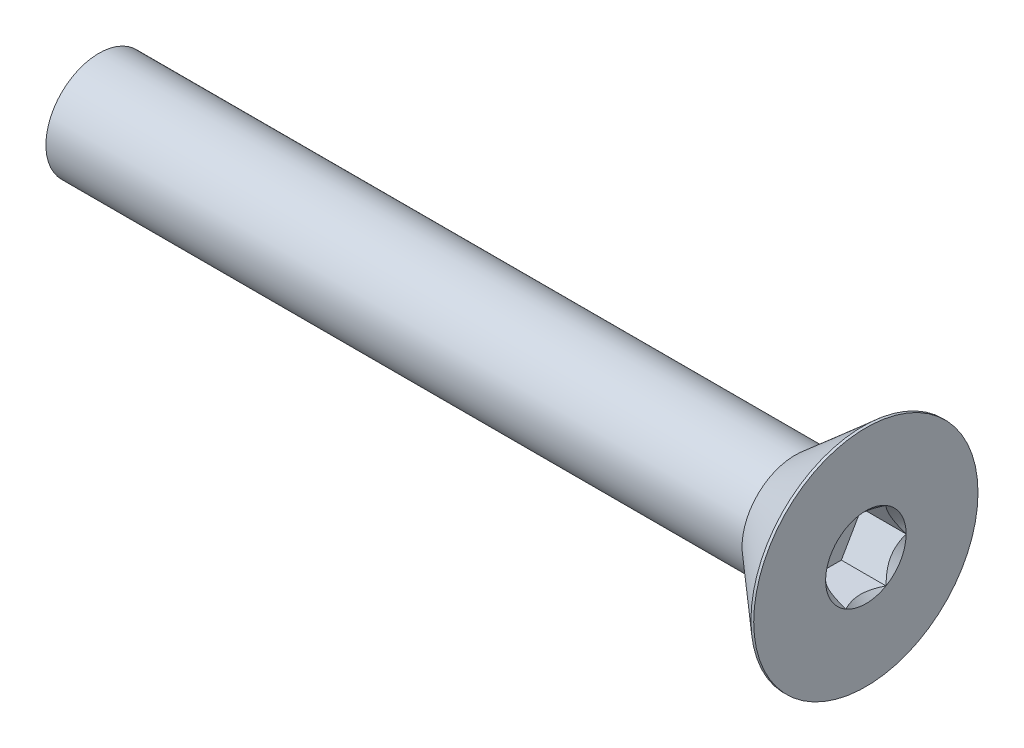
ISO-10303-21;
HEADER;
FILE_DESCRIPTION(('STEP AP214'),'2;1');
FILE_NAME('part.step','',(''),(''),'','','');
FILE_SCHEMA(('AUTOMOTIVE_DESIGN { 1 0 10303 214 1 1 1 1 }'));
ENDSEC;
DATA;
#1=APPLICATION_CONTEXT('core data for automotive mechanical design processes');
#2=APPLICATION_PROTOCOL_DEFINITION('international standard','automotive_design',2000,#1);
#3=PRODUCT_CONTEXT('',#1,'mechanical');
#4=PRODUCT('Part','Part','',(#3));
#5=PRODUCT_RELATED_PRODUCT_CATEGORY('part','',(#4));
#6=PRODUCT_DEFINITION_FORMATION('','',#4);
#7=PRODUCT_DEFINITION_CONTEXT('part definition',#1,'design');
#8=PRODUCT_DEFINITION('design','',#6,#7);
#9=PRODUCT_DEFINITION_SHAPE('','',#8);
#10=(LENGTH_UNIT() NAMED_UNIT(*) SI_UNIT(.MILLI.,.METRE.));
#11=(NAMED_UNIT(*) PLANE_ANGLE_UNIT() SI_UNIT($,.RADIAN.));
#12=(NAMED_UNIT(*) SI_UNIT($,.STERADIAN.) SOLID_ANGLE_UNIT());
#13=UNCERTAINTY_MEASURE_WITH_UNIT(LENGTH_MEASURE(1.E-05),#10,'distance_accuracy_value','');
#14=(GEOMETRIC_REPRESENTATION_CONTEXT(3) GLOBAL_UNCERTAINTY_ASSIGNED_CONTEXT((#13)) GLOBAL_UNIT_ASSIGNED_CONTEXT((#10,
#11,#12)) REPRESENTATION_CONTEXT('',''));
#15=CARTESIAN_POINT('',(0.,0.,0.));
#16=DIRECTION('',(0.,0.,1.));
#17=DIRECTION('',(1.,0.,0.));
#18=AXIS2_PLACEMENT_3D('',#15,#16,#17);
#19=CARTESIAN_POINT('',(1.193712867479,0.,0.));
#20=DIRECTION('',(1.,0.,0.));
#21=DIRECTION('',(0.,0.,-1.));
#22=AXIS2_PLACEMENT_3D('',#19,#20,#21);
#23=PLANE('',#22);
#24=DIRECTION('',(0.,-0.866025403784439,-0.5));
#25=VECTOR('',#24,1.);
#26=CARTESIAN_POINT('',(1.193712867479,-0.79375,1.3748153285078));
#27=LINE('',#26,#25);
#28=CARTESIAN_POINT('',(1.193712867479,0.,1.83308710467706));
#29=VERTEX_POINT('',#28);
#30=CARTESIAN_POINT('',(1.193712867479,-1.5875,0.916543552338532));
#31=VERTEX_POINT('',#30);
#32=EDGE_CURVE('E114',#29,#31,#27,.T.);
#33=ORIENTED_EDGE('',*,*,#32,.T.);
#34=DIRECTION('',(0.,0.,-1.));
#35=VECTOR('',#34,1.);
#36=CARTESIAN_POINT('',(1.193712867479,-1.5875,0.));
#37=LINE('',#36,#35);
#38=CARTESIAN_POINT('',(1.193712867479,-1.5875,-0.91654355233853));
#39=VERTEX_POINT('',#38);
#40=EDGE_CURVE('E81',#31,#39,#37,.T.);
#41=ORIENTED_EDGE('',*,*,#40,.T.);
#42=DIRECTION('',(0.,0.866025403784439,-0.5));
#43=VECTOR('',#42,1.);
#44=CARTESIAN_POINT('',(1.193712867479,-0.79375,-1.3748153285078));
#45=LINE('',#44,#43);
#46=CARTESIAN_POINT('',(1.193712867479,0.,-1.83308710467706));
#47=VERTEX_POINT('',#46);
#48=EDGE_CURVE('E83',#39,#47,#45,.T.);
#49=ORIENTED_EDGE('',*,*,#48,.T.);
#50=DIRECTION('',(0.,0.866025403784438,0.5));
#51=VECTOR('',#50,1.);
#52=CARTESIAN_POINT('',(1.193712867479,0.79375,-1.3748153285078));
#53=LINE('',#52,#51);
#54=CARTESIAN_POINT('',(1.193712867479,1.5875,-0.916543552338529));
#55=VERTEX_POINT('',#54);
#56=EDGE_CURVE('E84',#47,#55,#53,.T.);
#57=ORIENTED_EDGE('',*,*,#56,.T.);
#58=DIRECTION('',(0.,0.,1.));
#59=VECTOR('',#58,1.);
#60=CARTESIAN_POINT('',(1.193712867479,1.5875,0.));
#61=LINE('',#60,#59);
#62=CARTESIAN_POINT('',(1.193712867479,1.5875,0.916543552338531));
#63=VERTEX_POINT('',#62);
#64=EDGE_CURVE('E70',#55,#63,#61,.T.);
#65=ORIENTED_EDGE('',*,*,#64,.T.);
#66=DIRECTION('',(0.,-0.866025403784439,0.5));
#67=VECTOR('',#66,1.);
#68=CARTESIAN_POINT('',(1.193712867479,0.79375,1.3748153285078));
#69=LINE('',#68,#67);
#70=EDGE_CURVE('E109',#63,#29,#69,.T.);
#71=ORIENTED_EDGE('',*,*,#70,.T.);
#72=EDGE_LOOP('',(#33,#41,#49,#57,#65,#71));
#73=FACE_BOUND('',#72,.T.);
#74=ADVANCED_FACE('F16',(#73),#23,.T.);
#75=CARTESIAN_POINT('',(1.193712867479,0.79375,-1.3748153285078));
#76=DIRECTION('',(0.,0.5,-0.866025403784438));
#77=DIRECTION('',(0.,0.866025403784438,0.5));
#78=AXIS2_PLACEMENT_3D('',#75,#76,#77);
#79=PLANE('',#78);
#80=CARTESIAN_POINT('',(3.22571286750186,1.27190366490405E-11,-1.83308710467229));
#81=CARTESIAN_POINT('',(3.19424104986005,0.0545631502739884,-1.80158505517947));
#82=CARTESIAN_POINT('',(3.16461793028213,0.110038597583433,-1.76955629074127));
#83=CARTESIAN_POINT('',(3.11037926295554,0.223158727662726,-1.70424635318872));
#84=CARTESIAN_POINT('',(3.08579388372231,0.280814162284594,-1.67095897248972));
#85=CARTESIAN_POINT('',(3.04367896361078,0.39707351803509,-1.6038366021515));
#86=CARTESIAN_POINT('',(3.0260435970404,0.455647847371345,-1.57001869734156));
#87=CARTESIAN_POINT('',(2.99887295616836,0.574085662108213,-1.50163859312096));
#88=CARTESIAN_POINT('',(2.98931740761292,0.633945532003919,-1.46707848112303));
#89=CARTESIAN_POINT('',(2.98069560936949,0.737116774030597,-1.40751253676631));
#90=CARTESIAN_POINT('',(2.9794196892544,0.780294952191258,-1.38258360398213));
#91=CARTESIAN_POINT('',(2.98157200532222,0.866580665725205,-1.33276652404609));
#92=CARTESIAN_POINT('',(2.98500189035382,0.909688171036207,-1.30787839425069));
#93=CARTESIAN_POINT('',(2.99636918165353,0.995485199884442,-1.25834345654949));
#94=CARTESIAN_POINT('',(3.00431048768001,1.03817432925016,-1.23369687621872));
#95=CARTESIAN_POINT('',(3.02426914428968,1.12283605067518,-1.18481740856393));
#96=CARTESIAN_POINT('',(3.03628824374592,1.16480832716665,-1.16058470343308));
#97=CARTESIAN_POINT('',(3.0719566993385,1.27227527943506,-1.09853862961192));
#98=CARTESIAN_POINT('',(3.0982905750004,1.33710455598761,-1.06110942934294));
#99=CARTESIAN_POINT('',(3.14274348203233,1.43242888424927,-1.00607390276075));
#100=CARTESIAN_POINT('',(3.15836122675727,1.46384120989055,-0.987937988095882));
#101=CARTESIAN_POINT('',(3.19102231805198,1.52608848239935,-0.951999508556608));
#102=CARTESIAN_POINT('',(3.20806498626341,1.55692369555001,-0.934196789943556));
#103=CARTESIAN_POINT('',(3.22571286750293,1.58749999998813,-0.916543552345382));
#104=B_SPLINE_CURVE_WITH_KNOTS('',3,(#80,#81,#82,#83,#84,#85,#86,#87,#88,#89,#90,#91,#92,#93,
#94,#95,#96,#97,#98,#99,#100,#101,#102,#103),.UNSPECIFIED.,.F.,.F.,(4,2,2,2,2,2,2,2,2,2,2,4),
(0.,0.211427927693799,0.42408719707162,0.633370156309493,0.842126401366494,0.991537200904807,
1.14100036528198,1.29059292548924,1.44024972382122,1.67781721399119,1.79627069400735,
1.91466809992471),.UNSPECIFIED.);
#105=CARTESIAN_POINT('',(3.22571286750284,0.,-1.83308710467012));
#106=VERTEX_POINT('',#105);
#107=CARTESIAN_POINT('',(3.22571286750284,1.58749999999399,-0.916543552335056));
#108=VERTEX_POINT('',#107);
#109=EDGE_CURVE('E19',#106,#108,#104,.T.);
#110=ORIENTED_EDGE('',*,*,#109,.T.);
#111=DIRECTION('',(1.,0.,0.));
#112=VECTOR('',#111,1.);
#113=CARTESIAN_POINT('',(1.193712867479,1.5875,-0.916543552338529));
#114=LINE('',#113,#112);
#115=EDGE_CURVE('E89',#108,#55,#114,.F.);
#116=ORIENTED_EDGE('',*,*,#115,.T.);
#117=ORIENTED_EDGE('',*,*,#56,.F.);
#118=DIRECTION('',(1.,0.,0.));
#119=VECTOR('',#118,1.);
#120=CARTESIAN_POINT('',(1.193712867479,0.,-1.83308710467706));
#121=LINE('',#120,#119);
#122=EDGE_CURVE('E57',#47,#106,#121,.T.);
#123=ORIENTED_EDGE('',*,*,#122,.T.);
#124=EDGE_LOOP('',(#110,#116,#117,#123));
#125=FACE_BOUND('',#124,.T.);
#126=ADVANCED_FACE('F88',(#125),#79,.F.);
#127=CARTESIAN_POINT('',(1.193712867479,-0.79375,-1.3748153285078));
#128=DIRECTION('',(0.,-0.5,-0.866025403784439));
#129=DIRECTION('',(0.,0.866025403784439,-0.5));
#130=AXIS2_PLACEMENT_3D('',#127,#128,#129);
#131=PLANE('',#130);
#132=CARTESIAN_POINT('',(3.22571286750053,-1.58749999998325,-0.916543552347617));
#133=CARTESIAN_POINT('',(3.19424104985827,-1.53293684972208,-0.948045601839111));
#134=CARTESIAN_POINT('',(3.16461793028034,-1.47746140241289,-0.980074366276642));
#135=CARTESIAN_POINT('',(3.11037926295412,-1.36434127233427,-1.04538430382841));
#136=CARTESIAN_POINT('',(3.08579388372126,-1.30668583771283,-1.0786716845273));
#137=CARTESIAN_POINT('',(3.04367896361027,-1.19042648196318,-1.14579405486514));
#138=CARTESIAN_POINT('',(3.02604359704007,-1.13185215262735,-1.1796119596748));
#139=CARTESIAN_POINT('',(2.99887295616829,-1.01341433789136,-1.24799206389486));
#140=CARTESIAN_POINT('',(2.98931740761294,-0.9535544679961,-1.28255217589254));
#141=CARTESIAN_POINT('',(2.98069560936951,-0.850383225969922,-1.34211812024898));
#142=CARTESIAN_POINT('',(2.97941968925441,-0.807205047809308,-1.36704705303313));
#143=CARTESIAN_POINT('',(2.98157200532218,-0.720919334275457,-1.41686413296912));
#144=CARTESIAN_POINT('',(2.98500189035375,-0.677811828964505,-1.44175226276449));
#145=CARTESIAN_POINT('',(2.99636918165339,-0.592014800116357,-1.49128720046564));
#146=CARTESIAN_POINT('',(3.00431048767984,-0.549325670750674,-1.51593378079639));
#147=CARTESIAN_POINT('',(3.02426914428943,-0.464663949325729,-1.56481324845114));
#148=CARTESIAN_POINT('',(3.03628824374563,-0.422691672834298,-1.58904595358196));
#149=CARTESIAN_POINT('',(3.07195669933819,-0.315224720565743,-1.6510920274032));
#150=CARTESIAN_POINT('',(3.09829057500013,-0.25039544401301,-1.68852122767229));
#151=CARTESIAN_POINT('',(3.14274348203215,-0.15507111575111,-1.74355675425462));
#152=CARTESIAN_POINT('',(3.15836122675711,-0.123658790109747,-1.76169266891953));
#153=CARTESIAN_POINT('',(3.1910223180519,-0.0614115176007987,-1.7976311484589));
#154=CARTESIAN_POINT('',(3.20806498626337,-0.030576304450065,-1.81543386707199));
#155=CARTESIAN_POINT('',(3.22571286750293,-1.1869329529158E-11,-1.83308710467021));
#156=B_SPLINE_CURVE_WITH_KNOTS('',3,(#132,#133,#134,#135,#136,#137,#138,#139,#140,#141,#142,
#143,#144,#145,#146,#147,#148,#149,#150,#151,#152,#153,#154,#155),.UNSPECIFIED.,.F.,.F.,(4,2,2,
2,2,2,2,2,2,2,2,4),(0.,0.211427927692299,0.424087197068535,0.633370156304816,0.842126401360263,
0.991537200898412,1.14100036527541,1.29059292548253,1.44024972381435,1.67781721398494,
1.79627069400138,1.91466809991902),.UNSPECIFIED.);
#157=CARTESIAN_POINT('',(3.22571286747855,-1.58749999997296,-0.916543552322915));
#158=VERTEX_POINT('',#157);
#159=EDGE_CURVE('E93',#158,#106,#156,.T.);
#160=ORIENTED_EDGE('',*,*,#159,.T.);
#161=ORIENTED_EDGE('',*,*,#122,.F.);
#162=ORIENTED_EDGE('',*,*,#48,.F.);
#163=DIRECTION('',(1.,0.,0.));
#164=VECTOR('',#163,1.);
#165=CARTESIAN_POINT('',(1.193712867479,-1.5875,-0.91654355233853));
#166=LINE('',#165,#164);
#167=EDGE_CURVE('E95',#39,#158,#166,.T.);
#168=ORIENTED_EDGE('',*,*,#167,.T.);
#169=EDGE_LOOP('',(#160,#161,#162,#168));
#170=FACE_BOUND('',#169,.T.);
#171=ADVANCED_FACE('F91',(#170),#131,.F.);
#172=CARTESIAN_POINT('',(1.193712867479,-1.5875,0.));
#173=DIRECTION('',(0.,-1.,0.));
#174=DIRECTION('',(0.,0.,-1.));
#175=AXIS2_PLACEMENT_3D('',#172,#173,#174);
#176=PLANE('',#175);
#177=CARTESIAN_POINT('',(3.22571286750053,-1.5874999999995,0.916543552319482));
#178=CARTESIAN_POINT('',(3.19424104985925,-1.58749999999982,0.853539453324537));
#179=CARTESIAN_POINT('',(3.16461793028281,-1.58749999999995,0.789481924437113));
#180=CARTESIAN_POINT('',(3.11037926296095,-1.58750000000005,0.658862049308573));
#181=CARTESIAN_POINT('',(3.08579388373098,-1.58750000000001,0.592287287898146));
#182=CARTESIAN_POINT('',(3.04367896362744,-1.58749999999999,0.458042547197919));
#183=CARTESIAN_POINT('',(3.02604359706177,-1.5875,0.390406737566707));
#184=CARTESIAN_POINT('',(2.99887295620062,-1.5875,0.253646529103362));
#185=CARTESIAN_POINT('',(2.98931740765138,-1.5875,0.184526305096685));
#186=CARTESIAN_POINT('',(2.9806956094188,-1.5875,0.065394416357588));
#187=CARTESIAN_POINT('',(2.97941968930889,-1.5875,0.0155365507741219));
#188=CARTESIAN_POINT('',(2.98157200538873,-1.5875,-0.0840976091276274));
#189=CARTESIAN_POINT('',(2.98500189042718,-1.5875,-0.133873868732975));
#190=CARTESIAN_POINT('',(2.99636918174179,-1.5875,-0.232943744163808));
#191=CARTESIAN_POINT('',(3.00431048777632,-1.5875,-0.282236904839235));
#192=CARTESIAN_POINT('',(3.02426914440281,-1.5875,-0.379995840175979));
#193=CARTESIAN_POINT('',(3.03628824386782,-1.5875,-0.428461250450951));
#194=CARTESIAN_POINT('',(3.07195669946091,-1.5875,-0.552553398048427));
#195=CARTESIAN_POINT('',(3.09829057510559,-1.5875,-0.62741179853054));
#196=CARTESIAN_POINT('',(3.14274348210285,-1.5875,-0.737482851614946));
#197=CARTESIAN_POINT('',(3.15836122681472,-1.5875,-0.773754680918583));
#198=CARTESIAN_POINT('',(3.19102231808098,-1.5875,-0.845631639946218));
#199=CARTESIAN_POINT('',(3.20806498627704,-1.5875,-0.881237077147509));
#200=CARTESIAN_POINT('',(3.22571286750029,-1.5875,-0.916543552319548));
#201=B_SPLINE_CURVE_WITH_KNOTS('',3,(#177,#178,#179,#180,#181,#182,#183,#184,#185,#186,#187,
#188,#189,#190,#191,#192,#193,#194,#195,#196,#197,#198,#199,#200),.UNSPECIFIED.,.F.,.F.,(4,2,2,
2,2,2,2,2,2,2,2,4),(0.,0.211427927724625,0.424087197133195,0.633370156400541,0.842126401487028,
0.991537201070167,1.14100036549222,1.29059292574443,1.44024972412136,1.67781721411768,
1.79627069404646,1.91466809987682),.UNSPECIFIED.);
#202=CARTESIAN_POINT('',(3.22571286747855,-1.5875,0.916543552338532));
#203=VERTEX_POINT('',#202);
#204=EDGE_CURVE('E189',#203,#158,#201,.T.);
#205=ORIENTED_EDGE('',*,*,#204,.T.);
#206=ORIENTED_EDGE('',*,*,#167,.F.);
#207=ORIENTED_EDGE('',*,*,#40,.F.);
#208=DIRECTION('',(1.,0.,0.));
#209=VECTOR('',#208,1.);
#210=CARTESIAN_POINT('',(1.193712867479,-1.5875,0.916543552338532));
#211=LINE('',#210,#209);
#212=EDGE_CURVE('E111',#31,#203,#211,.T.);
#213=ORIENTED_EDGE('',*,*,#212,.T.);
#214=EDGE_LOOP('',(#205,#206,#207,#213));
#215=FACE_BOUND('',#214,.T.);
#216=ADVANCED_FACE('F198',(#215),#176,.F.);
#217=CARTESIAN_POINT('',(1.193712867479,-0.79375,1.3748153285078));
#218=DIRECTION('',(0.,-0.5,0.866025403784439));
#219=DIRECTION('',(0.,-0.866025403784439,-0.5));
#220=AXIS2_PLACEMENT_3D('',#217,#218,#219);
#221=PLANE('',#220);
#222=CARTESIAN_POINT('',(3.22571286750186,-1.27181945397336E-11,1.8330871046723));
#223=CARTESIAN_POINT('',(3.19424104986005,-0.0545631502739838,1.80158505517947));
#224=CARTESIAN_POINT('',(3.16461793028213,-0.110038597583424,1.76955629074127));
#225=CARTESIAN_POINT('',(3.11037926295555,-0.223158727662709,1.70424635318873));
#226=CARTESIAN_POINT('',(3.08579388372232,-0.280814162284573,1.67095897248974));
#227=CARTESIAN_POINT('',(3.04367896361078,-0.397073518035068,1.60383660215151));
#228=CARTESIAN_POINT('',(3.02604359704041,-0.455647847371328,1.57001869734157));
#229=CARTESIAN_POINT('',(2.99887295616836,-0.574085662108204,1.50163859312097));
#230=CARTESIAN_POINT('',(2.98931740761292,-0.633945532003914,1.46707848112304));
#231=CARTESIAN_POINT('',(2.98069560936948,-0.737116774030598,1.40751253676631));
#232=CARTESIAN_POINT('',(2.9794196892544,-0.780294952191261,1.38258360398213));
#233=CARTESIAN_POINT('',(2.98157200532222,-0.866580665725211,1.33276652404609));
#234=CARTESIAN_POINT('',(2.98500189035382,-0.909688171036214,1.30787839425069));
#235=CARTESIAN_POINT('',(2.99636918165353,-0.995485199884449,1.25834345654949));
#236=CARTESIAN_POINT('',(3.00431048768001,-1.03817432925017,1.23369687621872));
#237=CARTESIAN_POINT('',(3.02426914428968,-1.12283605067518,1.18481740856393));
#238=CARTESIAN_POINT('',(3.03628824374592,-1.16480832716665,1.16058470343308));
#239=CARTESIAN_POINT('',(3.07195669933823,-1.27227527943424,1.0985386296124));
#240=CARTESIAN_POINT('',(3.09829057499975,-1.337104555986,1.06110942934387));
#241=CARTESIAN_POINT('',(3.142743482031,-1.43242888424651,1.00607390276235));
#242=CARTESIAN_POINT('',(3.15836122675569,-1.46384120988742,0.987937988097692));
#243=CARTESIAN_POINT('',(3.19102231804989,-1.52608848239549,0.95199950855884));
#244=CARTESIAN_POINT('',(3.20806498626105,-1.55692369554579,0.934196789945994));
#245=CARTESIAN_POINT('',(3.22571286750029,-1.58749999998356,0.916543552348023));
#246=B_SPLINE_CURVE_WITH_KNOTS('',3,(#222,#223,#224,#225,#226,#227,#228,#229,#230,#231,#232,
#233,#234,#235,#236,#237,#238,#239,#240,#241,#242,#243,#244,#245),.UNSPECIFIED.,.F.,.F.,(4,2,2,
2,2,2,2,2,2,2,2,4),(0.,0.211427927693784,0.42408719707159,0.633370156309478,0.842126401366494,
0.991537200904813,1.14100036528199,1.29059292548925,1.44024972382122,1.67781721398823,
1.79627069400292,1.91466809991882),.UNSPECIFIED.);
#247=CARTESIAN_POINT('',(3.22571286750284,0.,1.83308710467012));
#248=VERTEX_POINT('',#247);
#249=EDGE_CURVE('E182',#248,#203,#246,.T.);
#250=ORIENTED_EDGE('',*,*,#249,.T.);
#251=ORIENTED_EDGE('',*,*,#212,.F.);
#252=ORIENTED_EDGE('',*,*,#32,.F.);
#253=DIRECTION('',(1.,0.,0.));
#254=VECTOR('',#253,1.);
#255=CARTESIAN_POINT('',(1.193712867479,0.,1.83308710467706));
#256=LINE('',#255,#254);
#257=EDGE_CURVE('E106',#29,#248,#256,.T.);
#258=ORIENTED_EDGE('',*,*,#257,.T.);
#259=EDGE_LOOP('',(#250,#251,#252,#258));
#260=FACE_BOUND('',#259,.T.);
#261=ADVANCED_FACE('F194',(#260),#221,.F.);
#262=CARTESIAN_POINT('',(1.193712867479,0.79375,1.3748153285078));
#263=DIRECTION('',(0.,0.5,0.866025403784439));
#264=DIRECTION('',(0.,-0.866025403784439,0.5));
#265=AXIS2_PLACEMENT_3D('',#262,#263,#264);
#266=PLANE('',#265);
#267=CARTESIAN_POINT('',(3.22571286750186,1.58749999998951,0.916543552347163));
#268=CARTESIAN_POINT('',(3.19424104986005,1.53293684972681,0.948045601837517));
#269=CARTESIAN_POINT('',(3.16461793028213,1.47746140241678,0.9800743662747));
#270=CARTESIAN_POINT('',(3.11037926295554,1.36434127233706,1.0453843038265));
#271=CARTESIAN_POINT('',(3.08579388372231,1.30668583771535,1.07867168452577));
#272=CARTESIAN_POINT('',(3.04367896361078,1.19042648196497,1.1457940548642));
#273=CARTESIAN_POINT('',(3.0260435970404,1.13185215262867,1.17961195967406));
#274=CARTESIAN_POINT('',(2.99887295616836,1.01341433789177,1.2479920638946));
#275=CARTESIAN_POINT('',(2.98931740761292,0.953554467996078,1.28255217589255));
#276=CARTESIAN_POINT('',(2.98069560936948,0.850383225969407,1.34211812024929));
#277=CARTESIAN_POINT('',(2.9794196892544,0.807205047808743,1.36704705303346));
#278=CARTESIAN_POINT('',(2.98157200532222,0.720919334274794,1.4168641329695));
#279=CARTESIAN_POINT('',(2.98500189035382,0.677811828963794,1.4417522627649));
#280=CARTESIAN_POINT('',(2.99636918165353,0.592014800115559,1.4912872004661));
#281=CARTESIAN_POINT('',(3.00431048768001,0.549325670749838,1.51593378079687));
#282=CARTESIAN_POINT('',(3.02426914428968,0.464663949324819,1.56481324845166));
#283=CARTESIAN_POINT('',(3.03628824374592,0.422691672833352,1.58904595358251));
#284=CARTESIAN_POINT('',(3.0719566993385,0.315224720564944,1.65109202740367));
#285=CARTESIAN_POINT('',(3.0982905750004,0.250395444012386,1.68852122767266));
#286=CARTESIAN_POINT('',(3.14274348203233,0.155071115750735,1.74355675425484));
#287=CARTESIAN_POINT('',(3.15836122675727,0.123658790109449,1.76169266891971));
#288=CARTESIAN_POINT('',(3.19102231805198,0.0614115176006523,1.79763114845898));
#289=CARTESIAN_POINT('',(3.20806498626341,0.0305763044499931,1.81543386707204));
#290=CARTESIAN_POINT('',(3.22571286750293,1.18705256372643E-11,1.83308710467021));
#291=B_SPLINE_CURVE_WITH_KNOTS('',3,(#267,#268,#269,#270,#271,#272,#273,#274,#275,#276,#277,
#278,#279,#280,#281,#282,#283,#284,#285,#286,#287,#288,#289,#290),.UNSPECIFIED.,.F.,.F.,(4,2,2,
2,2,2,2,2,2,2,2,4),(0.,0.211427927693799,0.42408719707162,0.633370156309492,0.842126401366493,
0.991537200904807,1.14100036528198,1.29059292548924,1.44024972382122,1.67781721399119,
1.79627069400735,1.91466809992471),.UNSPECIFIED.);
#292=CARTESIAN_POINT('',(3.22571286750284,1.58749999999399,0.91654355233506));
#293=VERTEX_POINT('',#292);
#294=EDGE_CURVE('E153',#293,#248,#291,.T.);
#295=ORIENTED_EDGE('',*,*,#294,.T.);
#296=ORIENTED_EDGE('',*,*,#257,.F.);
#297=ORIENTED_EDGE('',*,*,#70,.F.);
#298=DIRECTION('',(1.,0.,0.));
#299=VECTOR('',#298,1.);
#300=CARTESIAN_POINT('',(1.193712867479,1.5875,0.916543552338531));
#301=LINE('',#300,#299);
#302=EDGE_CURVE('E38',#63,#293,#301,.T.);
#303=ORIENTED_EDGE('',*,*,#302,.T.);
#304=EDGE_LOOP('',(#295,#296,#297,#303));
#305=FACE_BOUND('',#304,.T.);
#306=ADVANCED_FACE('F197',(#305),#266,.F.);
#307=CARTESIAN_POINT('',(1.193712867479,1.5875,0.));
#308=DIRECTION('',(0.,1.,0.));
#309=DIRECTION('',(0.,0.,1.));
#310=AXIS2_PLACEMENT_3D('',#307,#308,#309);
#311=PLANE('',#310);
#312=CARTESIAN_POINT('',(3.22571286750186,1.58750000000223,-0.91654355232513));
#313=CARTESIAN_POINT('',(3.19424104986005,1.5875000000008,-0.853539453341949));
#314=CARTESIAN_POINT('',(3.16461793028213,1.58750000000022,-0.789481924466565));
#315=CARTESIAN_POINT('',(3.11037926295554,1.58749999999978,-0.658862049362226));
#316=CARTESIAN_POINT('',(3.08579388372231,1.58749999999994,-0.592287287963956));
#317=CARTESIAN_POINT('',(3.04367896361078,1.58750000000006,-0.4580425472873));
#318=CARTESIAN_POINT('',(3.0260435970404,1.58750000000002,-0.390406737667498));
#319=CARTESIAN_POINT('',(2.99887295616836,1.58749999999999,-0.253646529226359));
#320=CARTESIAN_POINT('',(2.98931740761292,1.5875,-0.184526305230481));
#321=CARTESIAN_POINT('',(2.98069560936949,1.5875,-0.0653944165170242));
#322=CARTESIAN_POINT('',(2.9794196892544,1.5875,-0.0155365509486719));
#323=CARTESIAN_POINT('',(2.98157200532222,1.5875,0.0840976089234156));
#324=CARTESIAN_POINT('',(2.98500189035382,1.5875,0.133873868514215));
#325=CARTESIAN_POINT('',(2.99636918165353,1.5875,0.232943743916612));
#326=CARTESIAN_POINT('',(3.00431048768001,1.5875,0.282236904578152));
#327=CARTESIAN_POINT('',(3.02426914428968,1.5875,0.379995839887736));
#328=CARTESIAN_POINT('',(3.03628824374592,1.5875,0.428461250149434));
#329=CARTESIAN_POINT('',(3.0719566993385,1.5875,0.552553397791743));
#330=CARTESIAN_POINT('',(3.0982905750004,1.5875,0.627411798329719));
#331=CARTESIAN_POINT('',(3.14274348203233,1.5875,0.737482851494088));
#332=CARTESIAN_POINT('',(3.15836122675727,1.5875,0.773754680823825));
#333=CARTESIAN_POINT('',(3.19102231805198,1.5875,0.845631639902373));
#334=CARTESIAN_POINT('',(3.20806498626341,1.5875,0.881237077128478));
#335=CARTESIAN_POINT('',(3.22571286750293,1.5875,0.916543552324826));
#336=B_SPLINE_CURVE_WITH_KNOTS('',3,(#312,#313,#314,#315,#316,#317,#318,#319,#320,#321,#322,
#323,#324,#325,#326,#327,#328,#329,#330,#331,#332,#333,#334,#335),.UNSPECIFIED.,.F.,.F.,(4,2,2,
2,2,2,2,2,2,2,2,4),(0.,0.211427927693799,0.424087197071619,0.633370156309492,0.842126401366492,
0.991537200904806,1.14100036528198,1.29059292548924,1.44024972382121,1.67781721399119,
1.79627069400735,1.91466809992471),.UNSPECIFIED.);
#337=EDGE_CURVE('E146',#108,#293,#336,.T.);
#338=ORIENTED_EDGE('',*,*,#337,.T.);
#339=ORIENTED_EDGE('',*,*,#302,.F.);
#340=ORIENTED_EDGE('',*,*,#64,.F.);
#341=ORIENTED_EDGE('',*,*,#115,.F.);
#342=EDGE_LOOP('',(#338,#339,#340,#341));
#343=FACE_BOUND('',#342,.T.);
#344=ADVANCED_FACE('F160',(#343),#311,.F.);
#345=CARTESIAN_POINT('',(3.22571286739048,0.,0.));
#346=DIRECTION('',(1.,0.,0.));
#347=DIRECTION('',(0.,0.,-1.));
#348=AXIS2_PLACEMENT_3D('',#345,#346,#347);
#349=CONICAL_SURFACE('',#348,1.83308710455776,0.785398163397448);
#350=ORIENTED_EDGE('',*,*,#109,.F.);
#351=CARTESIAN_POINT('',(3.22571286750417,0.,0.));
#352=DIRECTION('',(1.,0.,0.));
#353=DIRECTION('',(0.,0.,-1.));
#354=AXIS2_PLACEMENT_3D('',#351,#352,#353);
#355=CIRCLE('',#354,1.83308710467145);
#356=EDGE_CURVE('E143',#108,#106,#355,.F.);
#357=ORIENTED_EDGE('',*,*,#356,.F.);
#358=EDGE_LOOP('',(#350,#357));
#359=FACE_BOUND('',#358,.T.);
#360=ADVANCED_FACE('F214',(#359),#349,.F.);
#361=CARTESIAN_POINT('',(3.22571286739048,0.,0.));
#362=DIRECTION('',(1.,0.,0.));
#363=DIRECTION('',(0.,0.,-1.));
#364=AXIS2_PLACEMENT_3D('',#361,#362,#363);
#365=CONICAL_SURFACE('',#364,1.83308710455776,0.785398163397448);
#366=ORIENTED_EDGE('',*,*,#159,.F.);
#367=CARTESIAN_POINT('',(3.22571286750417,0.,0.));
#368=DIRECTION('',(1.,0.,0.));
#369=DIRECTION('',(0.,0.,-1.));
#370=AXIS2_PLACEMENT_3D('',#367,#368,#369);
#371=CIRCLE('',#370,1.83308710467145);
#372=EDGE_CURVE('E140',#106,#158,#371,.F.);
#373=ORIENTED_EDGE('',*,*,#372,.F.);
#374=EDGE_LOOP('',(#366,#373));
#375=FACE_BOUND('',#374,.T.);
#376=ADVANCED_FACE('F211',(#375),#365,.F.);
#377=CARTESIAN_POINT('',(3.22571286739048,0.,0.));
#378=DIRECTION('',(1.,0.,0.));
#379=DIRECTION('',(0.,0.,-1.));
#380=AXIS2_PLACEMENT_3D('',#377,#378,#379);
#381=CONICAL_SURFACE('',#380,1.83308710455776,0.785398163512482);
#382=ORIENTED_EDGE('',*,*,#204,.F.);
#383=CARTESIAN_POINT('',(3.22571286744733,0.,0.));
#384=DIRECTION('',(1.,0.,0.));
#385=DIRECTION('',(0.,0.,-1.));
#386=AXIS2_PLACEMENT_3D('',#383,#384,#385);
#387=CIRCLE('',#386,1.83308710461461);
#388=EDGE_CURVE('E137',#158,#203,#387,.F.);
#389=ORIENTED_EDGE('',*,*,#388,.F.);
#390=EDGE_LOOP('',(#382,#389));
#391=FACE_BOUND('',#390,.T.);
#392=ADVANCED_FACE('F178',(#391),#381,.F.);
#393=CARTESIAN_POINT('',(3.22571286739048,0.,0.));
#394=DIRECTION('',(1.,0.,0.));
#395=DIRECTION('',(0.,0.,-1.));
#396=AXIS2_PLACEMENT_3D('',#393,#394,#395);
#397=CONICAL_SURFACE('',#396,1.83308710455776,0.785398163397448);
#398=ORIENTED_EDGE('',*,*,#249,.F.);
#399=CARTESIAN_POINT('',(3.22571286750417,0.,0.));
#400=DIRECTION('',(1.,0.,0.));
#401=DIRECTION('',(0.,0.,-1.));
#402=AXIS2_PLACEMENT_3D('',#399,#400,#401);
#403=CIRCLE('',#402,1.83308710467145);
#404=EDGE_CURVE('E134',#203,#248,#403,.F.);
#405=ORIENTED_EDGE('',*,*,#404,.F.);
#406=EDGE_LOOP('',(#398,#405));
#407=FACE_BOUND('',#406,.T.);
#408=ADVANCED_FACE('F173',(#407),#397,.F.);
#409=CARTESIAN_POINT('',(3.22571286739048,0.,0.));
#410=DIRECTION('',(1.,0.,0.));
#411=DIRECTION('',(0.,0.,-1.));
#412=AXIS2_PLACEMENT_3D('',#409,#410,#411);
#413=CONICAL_SURFACE('',#412,1.83308710455776,0.785398163397448);
#414=ORIENTED_EDGE('',*,*,#294,.F.);
#415=CARTESIAN_POINT('',(3.22571286750417,0.,0.));
#416=DIRECTION('',(1.,0.,0.));
#417=DIRECTION('',(0.,0.,-1.));
#418=AXIS2_PLACEMENT_3D('',#415,#416,#417);
#419=CIRCLE('',#418,1.83308710467145);
#420=EDGE_CURVE('E131',#248,#293,#419,.F.);
#421=ORIENTED_EDGE('',*,*,#420,.F.);
#422=EDGE_LOOP('',(#414,#421));
#423=FACE_BOUND('',#422,.T.);
#424=ADVANCED_FACE('F167',(#423),#413,.F.);
#425=CARTESIAN_POINT('',(3.22571286739048,0.,0.));
#426=DIRECTION('',(1.,0.,0.));
#427=DIRECTION('',(0.,0.,-1.));
#428=AXIS2_PLACEMENT_3D('',#425,#426,#427);
#429=CONICAL_SURFACE('',#428,1.83308710455776,0.785398163397448);
#430=ORIENTED_EDGE('',*,*,#337,.F.);
#431=CARTESIAN_POINT('',(3.22571286750417,0.,0.));
#432=DIRECTION('',(1.,0.,0.));
#433=DIRECTION('',(0.,0.,-1.));
#434=AXIS2_PLACEMENT_3D('',#431,#432,#433);
#435=CIRCLE('',#434,1.83308710467145);
#436=EDGE_CURVE('E128',#293,#108,#435,.F.);
#437=ORIENTED_EDGE('',*,*,#436,.F.);
#438=EDGE_LOOP('',(#430,#437));
#439=FACE_BOUND('',#438,.T.);
#440=ADVANCED_FACE('F162',(#439),#429,.F.);
#441=CARTESIAN_POINT('',(3.225712867479,0.,-5.10667));
#442=DIRECTION('',(1.,0.,0.));
#443=DIRECTION('',(0.,0.,-1.));
#444=AXIS2_PLACEMENT_3D('',#441,#442,#443);
#445=PLANE('',#444);
#446=CARTESIAN_POINT('',(3.225712867479,0.,0.));
#447=DIRECTION('',(1.,0.,0.));
#448=DIRECTION('',(0.,0.,-1.));
#449=AXIS2_PLACEMENT_3D('',#446,#447,#448);
#450=CIRCLE('',#449,5.10667);
#451=CARTESIAN_POINT('',(3.225712867479,0.,-5.10667));
#452=VERTEX_POINT('',#451);
#453=EDGE_CURVE('E125',#452,#452,#450,.F.);
#454=ORIENTED_EDGE('',*,*,#453,.F.);
#455=EDGE_LOOP('',(#454));
#456=FACE_BOUND('',#455,.T.);
#457=ORIENTED_EDGE('',*,*,#420,.T.);
#458=ORIENTED_EDGE('',*,*,#436,.T.);
#459=ORIENTED_EDGE('',*,*,#356,.T.);
#460=ORIENTED_EDGE('',*,*,#372,.T.);
#461=ORIENTED_EDGE('',*,*,#388,.T.);
#462=ORIENTED_EDGE('',*,*,#404,.T.);
#463=EDGE_LOOP('',(#457,#458,#459,#460,#461,#462));
#464=FACE_BOUND('',#463,.T.);
#465=ADVANCED_FACE('F166',(#456,#464),#445,.T.);
#466=CARTESIAN_POINT('',(3.225712867479,0.,0.));
#467=DIRECTION('',(1.,0.,0.));
#468=DIRECTION('',(0.,0.,-1.));
#469=AXIS2_PLACEMENT_3D('',#466,#467,#468);
#470=CYLINDRICAL_SURFACE('',#469,5.10667);
#471=ORIENTED_EDGE('',*,*,#453,.T.);
#472=EDGE_LOOP('',(#471));
#473=FACE_BOUND('',#472,.T.);
#474=CARTESIAN_POINT('',(3.09871286748375,0.,0.));
#475=DIRECTION('',(1.,0.,0.));
#476=DIRECTION('',(0.,0.,-1.));
#477=AXIS2_PLACEMENT_3D('',#474,#475,#476);
#478=CIRCLE('',#477,5.10666999997511);
#479=CARTESIAN_POINT('',(3.09871286748375,0.,-5.10666999997511));
#480=VERTEX_POINT('',#479);
#481=EDGE_CURVE('E124',#480,#480,#478,.F.);
#482=ORIENTED_EDGE('',*,*,#481,.F.);
#483=EDGE_LOOP('',(#482));
#484=FACE_BOUND('',#483,.T.);
#485=ADVANCED_FACE('F238',(#473,#484),#470,.T.);
#486=CARTESIAN_POINT('',(-31.6992,0.,0.));
#487=DIRECTION('',(-1.,0.,0.));
#488=DIRECTION('',(0.,0.,1.));
#489=AXIS2_PLACEMENT_3D('',#486,#487,#488);
#490=PLANE('',#489);
#491=CARTESIAN_POINT('',(-31.6992,0.,0.));
#492=DIRECTION('',(1.,0.,0.));
#493=DIRECTION('',(0.,0.,-1.));
#494=AXIS2_PLACEMENT_3D('',#491,#492,#493);
#495=CIRCLE('',#494,2.413);
#496=CARTESIAN_POINT('',(-31.6992,0.,-2.41300000000001));
#497=VERTEX_POINT('',#496);
#498=EDGE_CURVE('E29',#497,#497,#495,.T.);
#499=ORIENTED_EDGE('',*,*,#498,.F.);
#500=EDGE_LOOP('',(#499));
#501=FACE_BOUND('',#500,.T.);
#502=ADVANCED_FACE('F232',(#501),#490,.T.);
#503=CARTESIAN_POINT('',(3.09871286731322,0.,0.));
#504=DIRECTION('',(1.,0.,0.));
#505=DIRECTION('',(0.,0.,-1.));
#506=AXIS2_PLACEMENT_3D('',#503,#504,#505);
#507=CONICAL_SURFACE('',#506,5.10666999980458,0.71558499331418);
#508=ORIENTED_EDGE('',*,*,#481,.T.);
#509=EDGE_LOOP('',(#508));
#510=FACE_BOUND('',#509,.T.);
#511=CARTESIAN_POINT('',(0.,0.,0.));
#512=DIRECTION('',(1.,0.,0.));
#513=DIRECTION('',(0.,0.,-1.));
#514=AXIS2_PLACEMENT_3D('',#511,#512,#513);
#515=CIRCLE('',#514,2.413);
#516=CARTESIAN_POINT('',(0.,0.,-2.413));
#517=VERTEX_POINT('',#516);
#518=EDGE_CURVE('E11',#517,#517,#515,.F.);
#519=ORIENTED_EDGE('',*,*,#518,.F.);
#520=EDGE_LOOP('',(#519));
#521=FACE_BOUND('',#520,.T.);
#522=ADVANCED_FACE('F226',(#510,#521),#507,.T.);
#523=CARTESIAN_POINT('',(-31.6992,0.,0.));
#524=DIRECTION('',(1.,0.,0.));
#525=DIRECTION('',(0.,0.,-1.));
#526=AXIS2_PLACEMENT_3D('',#523,#524,#525);
#527=CYLINDRICAL_SURFACE('',#526,2.413);
#528=ORIENTED_EDGE('',*,*,#518,.T.);
#529=EDGE_LOOP('',(#528));
#530=FACE_BOUND('',#529,.T.);
#531=ORIENTED_EDGE('',*,*,#498,.T.);
#532=EDGE_LOOP('',(#531));
#533=FACE_BOUND('',#532,.T.);
#534=ADVANCED_FACE('F224',(#530,#533),#527,.T.);
#535=CLOSED_SHELL('',(#74,#126,#171,#216,#261,#306,#344,#360,#376,#392,#408,#424,#440,#465,#485,
#502,#522,#534));
#536=MANIFOLD_SOLID_BREP('B1',#535);
#537=ADVANCED_BREP_SHAPE_REPRESENTATION('',(#18,#536),#14);
#538=SHAPE_DEFINITION_REPRESENTATION(#9,#537);
ENDSEC;
END-ISO-10303-21;
